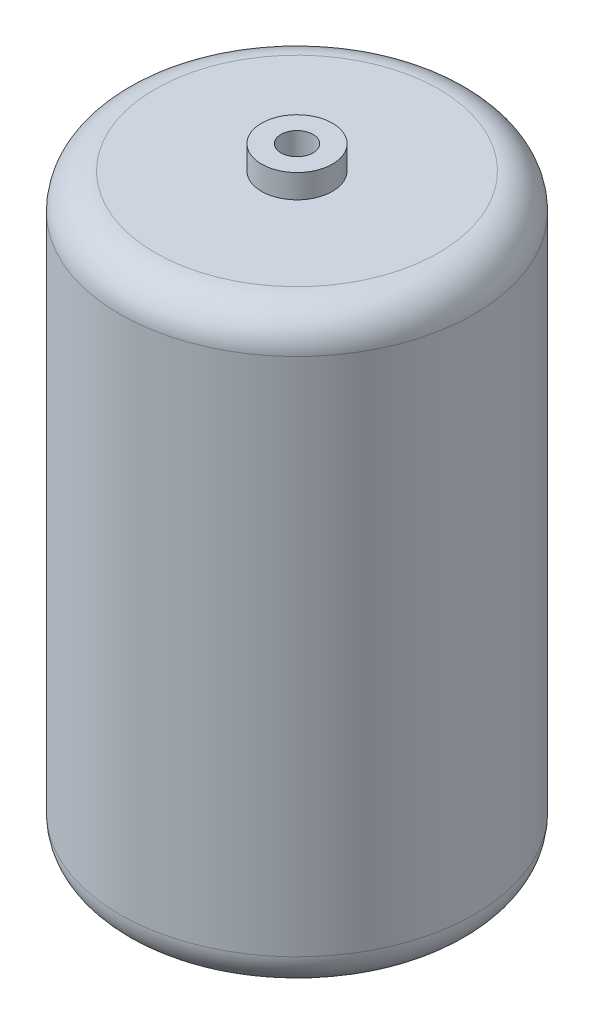
ISO-10303-21;
HEADER;
FILE_DESCRIPTION(('STEP AP214'),'2;1');
FILE_NAME('part.step','',(''),(''),'','','');
FILE_SCHEMA(('AUTOMOTIVE_DESIGN { 1 0 10303 214 1 1 1 1 }'));
ENDSEC;
DATA;
#1=APPLICATION_CONTEXT('core data for automotive mechanical design processes');
#2=APPLICATION_PROTOCOL_DEFINITION('international standard','automotive_design',2000,#1);
#3=PRODUCT_CONTEXT('',#1,'mechanical');
#4=PRODUCT('Part','Part','',(#3));
#5=PRODUCT_RELATED_PRODUCT_CATEGORY('part','',(#4));
#6=PRODUCT_DEFINITION_FORMATION('','',#4);
#7=PRODUCT_DEFINITION_CONTEXT('part definition',#1,'design');
#8=PRODUCT_DEFINITION('design','',#6,#7);
#9=PRODUCT_DEFINITION_SHAPE('','',#8);
#10=(LENGTH_UNIT() NAMED_UNIT(*) SI_UNIT(.MILLI.,.METRE.));
#11=(NAMED_UNIT(*) PLANE_ANGLE_UNIT() SI_UNIT($,.RADIAN.));
#12=(NAMED_UNIT(*) SI_UNIT($,.STERADIAN.) SOLID_ANGLE_UNIT());
#13=UNCERTAINTY_MEASURE_WITH_UNIT(LENGTH_MEASURE(1.E-05),#10,'distance_accuracy_value','');
#14=(GEOMETRIC_REPRESENTATION_CONTEXT(3) GLOBAL_UNCERTAINTY_ASSIGNED_CONTEXT((#13)) GLOBAL_UNIT_ASSIGNED_CONTEXT((#10,
#11,#12)) REPRESENTATION_CONTEXT('',''));
#15=CARTESIAN_POINT('',(0.,0.,0.));
#16=DIRECTION('',(0.,0.,1.));
#17=DIRECTION('',(1.,0.,0.));
#18=AXIS2_PLACEMENT_3D('',#15,#16,#17);
#19=CARTESIAN_POINT('',(0.,63.5,0.));
#20=DIRECTION('',(0.,-1.,0.));
#21=DIRECTION('',(0.,0.,-1.));
#22=AXIS2_PLACEMENT_3D('',#19,#20,#21);
#23=CYLINDRICAL_SURFACE('',#22,19.05);
#24=CARTESIAN_POINT('',(0.,3.81,0.));
#25=DIRECTION('',(0.,1.,0.));
#26=DIRECTION('',(0.,0.,1.));
#27=AXIS2_PLACEMENT_3D('',#24,#25,#26);
#28=CIRCLE('',#27,19.05);
#29=CARTESIAN_POINT('',(0.,3.81,19.05));
#30=VERTEX_POINT('',#29);
#31=EDGE_CURVE('E55',#30,#30,#28,.T.);
#32=ORIENTED_EDGE('',*,*,#31,.T.);
#33=EDGE_LOOP('',(#32));
#34=FACE_BOUND('',#33,.T.);
#35=CARTESIAN_POINT('',(0.,59.69,0.));
#36=DIRECTION('',(0.,1.,0.));
#37=DIRECTION('',(0.,0.,1.));
#38=AXIS2_PLACEMENT_3D('',#35,#36,#37);
#39=CIRCLE('',#38,19.05);
#40=CARTESIAN_POINT('',(0.,59.69,19.05));
#41=VERTEX_POINT('',#40);
#42=EDGE_CURVE('E60',#41,#41,#39,.F.);
#43=ORIENTED_EDGE('',*,*,#42,.T.);
#44=EDGE_LOOP('',(#43));
#45=FACE_BOUND('',#44,.T.);
#46=ADVANCED_FACE('F43',(#34,#45),#23,.T.);
#47=CARTESIAN_POINT('',(0.,63.5,0.));
#48=DIRECTION('',(0.,1.,0.));
#49=DIRECTION('',(0.,0.,1.));
#50=AXIS2_PLACEMENT_3D('',#47,#48,#49);
#51=PLANE('',#50);
#52=CARTESIAN_POINT('',(0.,63.5,0.));
#53=DIRECTION('',(0.,1.,0.));
#54=DIRECTION('',(0.,0.,1.));
#55=AXIS2_PLACEMENT_3D('',#52,#53,#54);
#56=CIRCLE('',#55,3.81);
#57=CARTESIAN_POINT('',(0.,63.5,3.81));
#58=VERTEX_POINT('',#57);
#59=EDGE_CURVE('E64',#58,#58,#56,.T.);
#60=ORIENTED_EDGE('',*,*,#59,.F.);
#61=EDGE_LOOP('',(#60));
#62=FACE_BOUND('',#61,.T.);
#63=CARTESIAN_POINT('',(0.,63.5,0.));
#64=DIRECTION('',(0.,1.,0.));
#65=DIRECTION('',(0.,0.,1.));
#66=AXIS2_PLACEMENT_3D('',#63,#64,#65);
#67=CIRCLE('',#66,15.24);
#68=CARTESIAN_POINT('',(0.,63.5,15.24));
#69=VERTEX_POINT('',#68);
#70=EDGE_CURVE('E10',#69,#69,#67,.T.);
#71=ORIENTED_EDGE('',*,*,#70,.T.);
#72=EDGE_LOOP('',(#71));
#73=FACE_BOUND('',#72,.T.);
#74=ADVANCED_FACE('F91',(#62,#73),#51,.T.);
#75=CARTESIAN_POINT('',(0.,0.,0.));
#76=DIRECTION('',(0.,1.,0.));
#77=DIRECTION('',(0.,0.,1.));
#78=AXIS2_PLACEMENT_3D('',#75,#76,#77);
#79=PLANE('',#78);
#80=CARTESIAN_POINT('',(0.,0.,0.));
#81=DIRECTION('',(0.,1.,0.));
#82=DIRECTION('',(0.,0.,1.));
#83=AXIS2_PLACEMENT_3D('',#80,#81,#82);
#84=CIRCLE('',#83,15.24);
#85=CARTESIAN_POINT('',(0.,0.,15.24));
#86=VERTEX_POINT('',#85);
#87=EDGE_CURVE('E51',#86,#86,#84,.F.);
#88=ORIENTED_EDGE('',*,*,#87,.T.);
#89=EDGE_LOOP('',(#88));
#90=FACE_BOUND('',#89,.T.);
#91=ADVANCED_FACE('F97',(#90),#79,.F.);
#92=CARTESIAN_POINT('',(0.,3.81,0.));
#93=DIRECTION('',(0.,1.,0.));
#94=DIRECTION('',(0.,0.,1.));
#95=AXIS2_PLACEMENT_3D('',#92,#93,#94);
#96=TOROIDAL_SURFACE('',#95,15.24,3.81);
#97=ORIENTED_EDGE('',*,*,#87,.F.);
#98=EDGE_LOOP('',(#97));
#99=FACE_BOUND('',#98,.T.);
#100=ORIENTED_EDGE('',*,*,#31,.F.);
#101=EDGE_LOOP('',(#100));
#102=FACE_BOUND('',#101,.T.);
#103=ADVANCED_FACE('F102',(#99,#102),#96,.T.);
#104=CARTESIAN_POINT('',(0.,59.69,0.));
#105=DIRECTION('',(0.,1.,0.));
#106=DIRECTION('',(0.,0.,1.));
#107=AXIS2_PLACEMENT_3D('',#104,#105,#106);
#108=TOROIDAL_SURFACE('',#107,15.24,3.81);
#109=ORIENTED_EDGE('',*,*,#42,.F.);
#110=EDGE_LOOP('',(#109));
#111=FACE_BOUND('',#110,.T.);
#112=ORIENTED_EDGE('',*,*,#70,.F.);
#113=EDGE_LOOP('',(#112));
#114=FACE_BOUND('',#113,.T.);
#115=ADVANCED_FACE('F45',(#111,#114),#108,.T.);
#116=CARTESIAN_POINT('',(0.,66.04,0.));
#117=DIRECTION('',(0.,-1.,0.));
#118=DIRECTION('',(0.,0.,-1.));
#119=AXIS2_PLACEMENT_3D('',#116,#117,#118);
#120=CYLINDRICAL_SURFACE('',#119,3.81);
#121=CARTESIAN_POINT('',(0.,66.04,0.));
#122=DIRECTION('',(0.,1.,0.));
#123=DIRECTION('',(0.,0.,1.));
#124=AXIS2_PLACEMENT_3D('',#121,#122,#123);
#125=CIRCLE('',#124,3.81);
#126=CARTESIAN_POINT('',(0.,66.04,3.81));
#127=VERTEX_POINT('',#126);
#128=EDGE_CURVE('E63',#127,#127,#125,.T.);
#129=ORIENTED_EDGE('',*,*,#128,.F.);
#130=EDGE_LOOP('',(#129));
#131=FACE_BOUND('',#130,.T.);
#132=ORIENTED_EDGE('',*,*,#59,.T.);
#133=EDGE_LOOP('',(#132));
#134=FACE_BOUND('',#133,.T.);
#135=ADVANCED_FACE('F109',(#131,#134),#120,.T.);
#136=CARTESIAN_POINT('',(0.,66.04,0.));
#137=DIRECTION('',(0.,1.,0.));
#138=DIRECTION('',(0.,0.,1.));
#139=AXIS2_PLACEMENT_3D('',#136,#137,#138);
#140=PLANE('',#139);
#141=CARTESIAN_POINT('',(0.,66.04,0.));
#142=DIRECTION('',(0.,1.,0.));
#143=DIRECTION('',(0.,0.,1.));
#144=AXIS2_PLACEMENT_3D('',#141,#142,#143);
#145=CIRCLE('',#144,1.7272);
#146=CARTESIAN_POINT('',(0.,66.04,1.7272));
#147=VERTEX_POINT('',#146);
#148=EDGE_CURVE('E67',#147,#147,#145,.T.);
#149=ORIENTED_EDGE('',*,*,#148,.F.);
#150=EDGE_LOOP('',(#149));
#151=FACE_BOUND('',#150,.T.);
#152=ORIENTED_EDGE('',*,*,#128,.T.);
#153=EDGE_LOOP('',(#152));
#154=FACE_BOUND('',#153,.T.);
#155=ADVANCED_FACE('F159',(#151,#154),#140,.T.);
#156=CARTESIAN_POINT('',(0.,66.04,0.));
#157=DIRECTION('',(0.,1.,0.));
#158=DIRECTION('',(0.,0.,1.));
#159=AXIS2_PLACEMENT_3D('',#156,#157,#158);
#160=CYLINDRICAL_SURFACE('',#159,1.7272);
#161=CARTESIAN_POINT('',(0.,58.337188047315,0.));
#162=DIRECTION('',(0.,1.,0.));
#163=DIRECTION('',(0.,0.,1.));
#164=AXIS2_PLACEMENT_3D('',#161,#162,#163);
#165=CIRCLE('',#164,1.7272);
#166=CARTESIAN_POINT('',(0.,58.337188047315,1.7272));
#167=VERTEX_POINT('',#166);
#168=EDGE_CURVE('E47',#167,#167,#165,.F.);
#169=ORIENTED_EDGE('',*,*,#168,.T.);
#170=EDGE_LOOP('',(#169));
#171=FACE_BOUND('',#170,.T.);
#172=ORIENTED_EDGE('',*,*,#148,.T.);
#173=EDGE_LOOP('',(#172));
#174=FACE_BOUND('',#173,.T.);
#175=ADVANCED_FACE('F169',(#171,#174),#160,.F.);
#176=CARTESIAN_POINT('',(0.,58.337188047315,0.));
#177=DIRECTION('',(0.,1.,0.));
#178=DIRECTION('',(0.,0.,1.));
#179=AXIS2_PLACEMENT_3D('',#176,#177,#178);
#180=PLANE('',#179);
#181=CARTESIAN_POINT('',(0.,58.337188047315,0.));
#182=DIRECTION('',(0.,-1.,0.));
#183=DIRECTION('',(0.,0.,-1.));
#184=AXIS2_PLACEMENT_3D('',#181,#182,#183);
#185=CIRCLE('',#184,16.9073262738124);
#186=CARTESIAN_POINT('',(0.,58.337188047315,-16.9073262738124));
#187=VERTEX_POINT('',#186);
#188=EDGE_CURVE('E72',#187,#187,#185,.T.);
#189=ORIENTED_EDGE('',*,*,#188,.T.);
#190=EDGE_LOOP('',(#189));
#191=FACE_BOUND('',#190,.T.);
#192=ORIENTED_EDGE('',*,*,#168,.F.);
#193=EDGE_LOOP('',(#192));
#194=FACE_BOUND('',#193,.T.);
#195=ADVANCED_FACE('F87',(#191,#194),#180,.F.);
#196=CARTESIAN_POINT('',(0.,5.51274378250209,0.));
#197=DIRECTION('',(0.,-1.,0.));
#198=DIRECTION('',(0.,0.,-1.));
#199=AXIS2_PLACEMENT_3D('',#196,#197,#198);
#200=CYLINDRICAL_SURFACE('',#199,16.9073262738124);
#201=ORIENTED_EDGE('',*,*,#188,.F.);
#202=EDGE_LOOP('',(#201));
#203=FACE_BOUND('',#202,.T.);
#204=CARTESIAN_POINT('',(0.,5.51274378250209,0.));
#205=DIRECTION('',(0.,-1.,0.));
#206=DIRECTION('',(0.,0.,-1.));
#207=AXIS2_PLACEMENT_3D('',#204,#205,#206);
#208=CIRCLE('',#207,16.9073262738124);
#209=CARTESIAN_POINT('',(0.,5.51274378250209,-16.9073262738124));
#210=VERTEX_POINT('',#209);
#211=EDGE_CURVE('E75',#210,#210,#208,.T.);
#212=ORIENTED_EDGE('',*,*,#211,.T.);
#213=EDGE_LOOP('',(#212));
#214=FACE_BOUND('',#213,.T.);
#215=ADVANCED_FACE('F79',(#203,#214),#200,.F.);
#216=CARTESIAN_POINT('',(0.,5.51274378250209,0.));
#217=DIRECTION('',(0.,-1.,0.));
#218=DIRECTION('',(0.,0.,-1.));
#219=AXIS2_PLACEMENT_3D('',#216,#217,#218);
#220=PLANE('',#219);
#221=ORIENTED_EDGE('',*,*,#211,.F.);
#222=EDGE_LOOP('',(#221));
#223=FACE_BOUND('',#222,.T.);
#224=ADVANCED_FACE('F81',(#223),#220,.F.);
#225=CLOSED_SHELL('',(#46,#74,#91,#103,#115,#135,#155,#175,#195,#215,#224));
#226=MANIFOLD_SOLID_BREP('B2',#225);
#227=ADVANCED_BREP_SHAPE_REPRESENTATION('',(#18,#226),#14);
#228=SHAPE_DEFINITION_REPRESENTATION(#9,#227);
ENDSEC;
END-ISO-10303-21;
